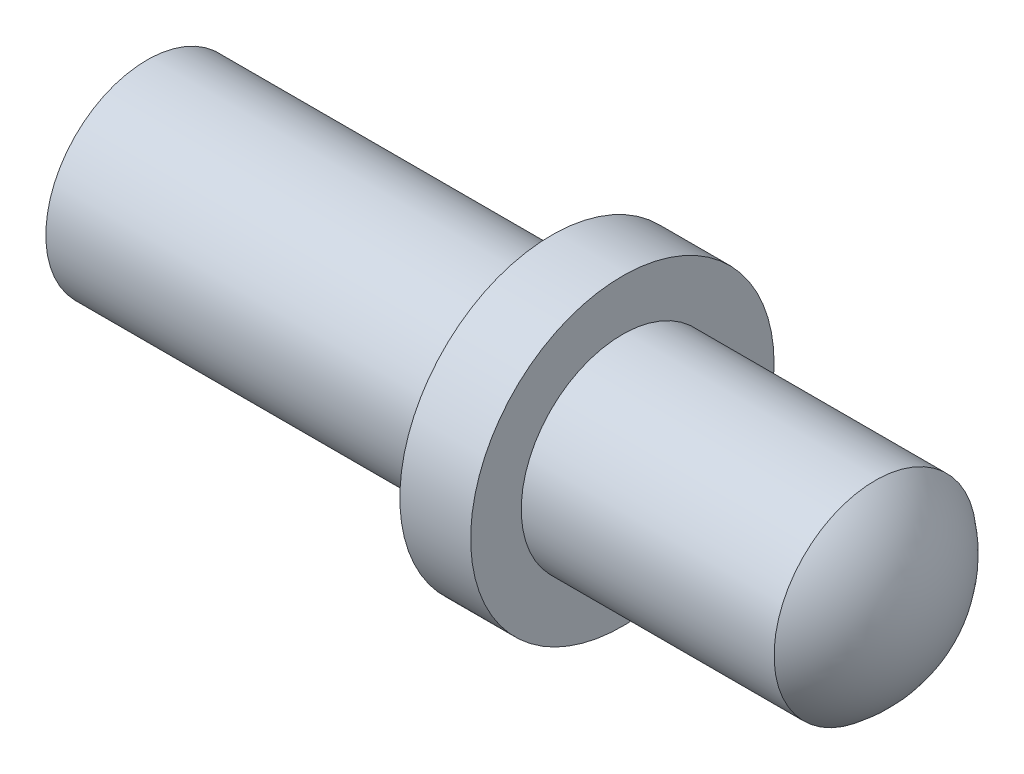
ISO-10303-21;
HEADER;
FILE_DESCRIPTION(('STEP AP214'),'2;1');
FILE_NAME('part.step','',(''),(''),'','','');
FILE_SCHEMA(('AUTOMOTIVE_DESIGN { 1 0 10303 214 1 1 1 1 }'));
ENDSEC;
DATA;
#1=APPLICATION_CONTEXT('core data for automotive mechanical design processes');
#2=APPLICATION_PROTOCOL_DEFINITION('international standard','automotive_design',2000,#1);
#3=PRODUCT_CONTEXT('',#1,'mechanical');
#4=PRODUCT('Part','Part','',(#3));
#5=PRODUCT_RELATED_PRODUCT_CATEGORY('part','',(#4));
#6=PRODUCT_DEFINITION_FORMATION('','',#4);
#7=PRODUCT_DEFINITION_CONTEXT('part definition',#1,'design');
#8=PRODUCT_DEFINITION('design','',#6,#7);
#9=PRODUCT_DEFINITION_SHAPE('','',#8);
#10=(LENGTH_UNIT() NAMED_UNIT(*) SI_UNIT(.MILLI.,.METRE.));
#11=(NAMED_UNIT(*) PLANE_ANGLE_UNIT() SI_UNIT($,.RADIAN.));
#12=(NAMED_UNIT(*) SI_UNIT($,.STERADIAN.) SOLID_ANGLE_UNIT());
#13=UNCERTAINTY_MEASURE_WITH_UNIT(LENGTH_MEASURE(1.E-05),#10,'distance_accuracy_value','');
#14=(GEOMETRIC_REPRESENTATION_CONTEXT(3) GLOBAL_UNCERTAINTY_ASSIGNED_CONTEXT((#13)) GLOBAL_UNIT_ASSIGNED_CONTEXT((#10,
#11,#12)) REPRESENTATION_CONTEXT('',''));
#15=CARTESIAN_POINT('',(0.,0.,0.));
#16=DIRECTION('',(0.,0.,1.));
#17=DIRECTION('',(1.,0.,0.));
#18=AXIS2_PLACEMENT_3D('',#15,#16,#17);
#19=CARTESIAN_POINT('',(0.,0.,0.));
#20=DIRECTION('',(-1.,0.,0.));
#21=DIRECTION('',(0.,0.,1.));
#22=AXIS2_PLACEMENT_3D('',#19,#20,#21);
#23=PLANE('',#22);
#24=CARTESIAN_POINT('',(0.,0.,0.));
#25=DIRECTION('',(1.,0.,0.));
#26=DIRECTION('',(0.,0.,-1.));
#27=AXIS2_PLACEMENT_3D('',#24,#25,#26);
#28=CIRCLE('',#27,2.);
#29=CARTESIAN_POINT('',(0.,0.,-2.));
#30=VERTEX_POINT('',#29);
#31=EDGE_CURVE('E11',#30,#30,#28,.T.);
#32=ORIENTED_EDGE('',*,*,#31,.F.);
#33=EDGE_LOOP('',(#32));
#34=FACE_BOUND('',#33,.T.);
#35=ADVANCED_FACE('F37',(#34),#23,.T.);
#36=CARTESIAN_POINT('',(14.4,0.,0.));
#37=DIRECTION('',(1.,0.,0.));
#38=DIRECTION('',(0.,0.,-1.));
#39=AXIS2_PLACEMENT_3D('',#36,#37,#38);
#40=CYLINDRICAL_SURFACE('',#39,2.);
#41=ORIENTED_EDGE('',*,*,#31,.T.);
#42=EDGE_LOOP('',(#41));
#43=FACE_BOUND('',#42,.T.);
#44=CARTESIAN_POINT('',(8.,0.,0.));
#45=DIRECTION('',(1.,0.,0.));
#46=DIRECTION('',(0.,0.,-1.));
#47=AXIS2_PLACEMENT_3D('',#44,#45,#46);
#48=CIRCLE('',#47,2.);
#49=CARTESIAN_POINT('',(8.,0.,-2.));
#50=VERTEX_POINT('',#49);
#51=EDGE_CURVE('E45',#50,#50,#48,.T.);
#52=ORIENTED_EDGE('',*,*,#51,.F.);
#53=EDGE_LOOP('',(#52));
#54=FACE_BOUND('',#53,.T.);
#55=ADVANCED_FACE('F78',(#43,#54),#40,.T.);
#56=CARTESIAN_POINT('',(8.,2.,0.));
#57=DIRECTION('',(-1.,0.,0.));
#58=DIRECTION('',(0.,0.,1.));
#59=AXIS2_PLACEMENT_3D('',#56,#57,#58);
#60=PLANE('',#59);
#61=ORIENTED_EDGE('',*,*,#51,.T.);
#62=EDGE_LOOP('',(#61));
#63=FACE_BOUND('',#62,.T.);
#64=CARTESIAN_POINT('',(8.,0.,0.));
#65=DIRECTION('',(1.,0.,0.));
#66=DIRECTION('',(0.,0.,-1.));
#67=AXIS2_PLACEMENT_3D('',#64,#65,#66);
#68=CIRCLE('',#67,3.);
#69=CARTESIAN_POINT('',(8.,0.,-3.));
#70=VERTEX_POINT('',#69);
#71=EDGE_CURVE('E49',#70,#70,#68,.T.);
#72=ORIENTED_EDGE('',*,*,#71,.F.);
#73=EDGE_LOOP('',(#72));
#74=FACE_BOUND('',#73,.T.);
#75=ADVANCED_FACE('F83',(#63,#74),#60,.T.);
#76=CARTESIAN_POINT('',(14.4,0.,0.));
#77=DIRECTION('',(1.,0.,0.));
#78=DIRECTION('',(0.,0.,-1.));
#79=AXIS2_PLACEMENT_3D('',#76,#77,#78);
#80=CYLINDRICAL_SURFACE('',#79,3.);
#81=ORIENTED_EDGE('',*,*,#71,.T.);
#82=EDGE_LOOP('',(#81));
#83=FACE_BOUND('',#82,.T.);
#84=CARTESIAN_POINT('',(9.4,0.,0.));
#85=DIRECTION('',(1.,0.,0.));
#86=DIRECTION('',(0.,0.,-1.));
#87=AXIS2_PLACEMENT_3D('',#84,#85,#86);
#88=CIRCLE('',#87,3.);
#89=CARTESIAN_POINT('',(9.4,0.,-3.));
#90=VERTEX_POINT('',#89);
#91=EDGE_CURVE('E55',#90,#90,#88,.T.);
#92=ORIENTED_EDGE('',*,*,#91,.F.);
#93=EDGE_LOOP('',(#92));
#94=FACE_BOUND('',#93,.T.);
#95=ADVANCED_FACE('F74',(#83,#94),#80,.T.);
#96=CARTESIAN_POINT('',(9.4,3.,0.));
#97=DIRECTION('',(1.,0.,0.));
#98=DIRECTION('',(0.,0.,-1.));
#99=AXIS2_PLACEMENT_3D('',#96,#97,#98);
#100=PLANE('',#99);
#101=ORIENTED_EDGE('',*,*,#91,.T.);
#102=EDGE_LOOP('',(#101));
#103=FACE_BOUND('',#102,.T.);
#104=CARTESIAN_POINT('',(9.4,0.,0.));
#105=DIRECTION('',(1.,0.,0.));
#106=DIRECTION('',(0.,0.,-1.));
#107=AXIS2_PLACEMENT_3D('',#104,#105,#106);
#108=CIRCLE('',#107,1.99999999999999);
#109=CARTESIAN_POINT('',(9.4,0.,-1.99999999999999));
#110=VERTEX_POINT('',#109);
#111=EDGE_CURVE('E58',#110,#110,#108,.T.);
#112=ORIENTED_EDGE('',*,*,#111,.F.);
#113=EDGE_LOOP('',(#112));
#114=FACE_BOUND('',#113,.T.);
#115=ADVANCED_FACE('F68',(#103,#114),#100,.T.);
#116=CARTESIAN_POINT('',(14.4,0.,0.));
#117=DIRECTION('',(1.,0.,0.));
#118=DIRECTION('',(0.,0.,-1.));
#119=AXIS2_PLACEMENT_3D('',#116,#117,#118);
#120=CYLINDRICAL_SURFACE('',#119,1.99999999999999);
#121=ORIENTED_EDGE('',*,*,#111,.T.);
#122=EDGE_LOOP('',(#121));
#123=FACE_BOUND('',#122,.T.);
#124=CARTESIAN_POINT('',(14.4,0.,0.));
#125=DIRECTION('',(1.,0.,0.));
#126=DIRECTION('',(0.,0.,-1.));
#127=AXIS2_PLACEMENT_3D('',#124,#125,#126);
#128=CIRCLE('',#127,1.99999999999999);
#129=CARTESIAN_POINT('',(14.4,0.,-1.99999999999999));
#130=VERTEX_POINT('',#129);
#131=EDGE_CURVE('E41',#130,#130,#128,.T.);
#132=ORIENTED_EDGE('',*,*,#131,.F.);
#133=EDGE_LOOP('',(#132));
#134=FACE_BOUND('',#133,.T.);
#135=ADVANCED_FACE('F66',(#123,#134),#120,.T.);
#136=CARTESIAN_POINT('',(12.9,0.,0.));
#137=DIRECTION('',(0.,0.,1.));
#138=DIRECTION('',(1.,0.,0.));
#139=AXIS2_PLACEMENT_3D('',#136,#137,#138);
#140=SPHERICAL_SURFACE('',#139,2.49999999999999);
#141=CARTESIAN_POINT('',(12.9,0.,0.));
#142=DIRECTION('',(1.,0.,0.));
#143=DIRECTION('',(0.,0.,-1.));
#144=AXIS2_PLACEMENT_3D('',#141,#142,#143);
#145=SPHERICAL_SURFACE('',#144,2.49999999999999);
#146=ORIENTED_EDGE('',*,*,#131,.T.);
#147=EDGE_LOOP('',(#146));
#148=FACE_BOUND('',#147,.T.);
#149=ADVANCED_FACE('F39',(#148),#145,.T.);
#150=CLOSED_SHELL('',(#35,#55,#75,#95,#115,#135,#149));
#151=MANIFOLD_SOLID_BREP('B2',#150);
#152=ADVANCED_BREP_SHAPE_REPRESENTATION('',(#18,#151),#14);
#153=SHAPE_DEFINITION_REPRESENTATION(#9,#152);
ENDSEC;
END-ISO-10303-21;
